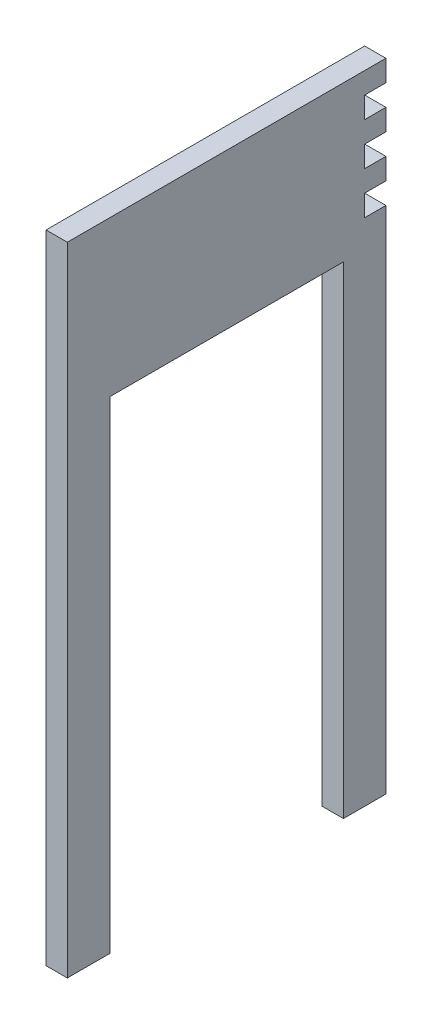
ISO-10303-21;
HEADER;
FILE_DESCRIPTION(('STEP AP214'),'2;1');
FILE_NAME('part.step','',(''),(''),'','','');
FILE_SCHEMA(('AUTOMOTIVE_DESIGN { 1 0 10303 214 1 1 1 1 }'));
ENDSEC;
DATA;
#1=APPLICATION_CONTEXT('core data for automotive mechanical design processes');
#2=APPLICATION_PROTOCOL_DEFINITION('international standard','automotive_design',2000,#1);
#3=PRODUCT_CONTEXT('',#1,'mechanical');
#4=PRODUCT('Part','Part','',(#3));
#5=PRODUCT_RELATED_PRODUCT_CATEGORY('part','',(#4));
#6=PRODUCT_DEFINITION_FORMATION('','',#4);
#7=PRODUCT_DEFINITION_CONTEXT('part definition',#1,'design');
#8=PRODUCT_DEFINITION('design','',#6,#7);
#9=PRODUCT_DEFINITION_SHAPE('','',#8);
#10=(LENGTH_UNIT() NAMED_UNIT(*) SI_UNIT(.MILLI.,.METRE.));
#11=(NAMED_UNIT(*) PLANE_ANGLE_UNIT() SI_UNIT($,.RADIAN.));
#12=(NAMED_UNIT(*) SI_UNIT($,.STERADIAN.) SOLID_ANGLE_UNIT());
#13=UNCERTAINTY_MEASURE_WITH_UNIT(LENGTH_MEASURE(1.E-05),#10,'distance_accuracy_value','');
#14=(GEOMETRIC_REPRESENTATION_CONTEXT(3) GLOBAL_UNCERTAINTY_ASSIGNED_CONTEXT((#13)) GLOBAL_UNIT_ASSIGNED_CONTEXT((#10,
#11,#12)) REPRESENTATION_CONTEXT('',''));
#15=CARTESIAN_POINT('',(0.,0.,0.));
#16=DIRECTION('',(0.,0.,1.));
#17=DIRECTION('',(1.,0.,0.));
#18=AXIS2_PLACEMENT_3D('',#15,#16,#17);
#19=CARTESIAN_POINT('',(10.,0.,0.));
#20=DIRECTION('',(0.,0.,1.));
#21=DIRECTION('',(0.,-1.,0.));
#22=AXIS2_PLACEMENT_3D('',#19,#20,#21);
#23=PLANE('',#22);
#24=DIRECTION('',(0.,1.,0.));
#25=VECTOR('',#24,1.);
#26=CARTESIAN_POINT('',(0.,0.,0.));
#27=LINE('',#26,#25);
#28=CARTESIAN_POINT('',(0.,-300.,0.));
#29=VERTEX_POINT('',#28);
#30=CARTESIAN_POINT('',(0.,-60.,0.));
#31=VERTEX_POINT('',#30);
#32=EDGE_CURVE('E194',#29,#31,#27,.T.);
#33=ORIENTED_EDGE('',*,*,#32,.T.);
#34=DIRECTION('',(1.,0.,0.));
#35=VECTOR('',#34,1.);
#36=CARTESIAN_POINT('',(0.,-60.,0.));
#37=LINE('',#36,#35);
#38=CARTESIAN_POINT('',(10.,-60.,0.));
#39=VERTEX_POINT('',#38);
#40=EDGE_CURVE('E283',#31,#39,#37,.T.);
#41=ORIENTED_EDGE('',*,*,#40,.T.);
#42=DIRECTION('',(0.,1.,0.));
#43=VECTOR('',#42,1.);
#44=CARTESIAN_POINT('',(10.,0.,0.));
#45=LINE('',#44,#43);
#46=CARTESIAN_POINT('',(10.,-300.,0.));
#47=VERTEX_POINT('',#46);
#48=EDGE_CURVE('E276',#47,#39,#45,.T.);
#49=ORIENTED_EDGE('',*,*,#48,.F.);
#50=DIRECTION('',(-1.,0.,0.));
#51=VECTOR('',#50,1.);
#52=CARTESIAN_POINT('',(10.,-300.,0.));
#53=LINE('',#52,#51);
#54=EDGE_CURVE('E218',#47,#29,#53,.T.);
#55=ORIENTED_EDGE('',*,*,#54,.T.);
#56=EDGE_LOOP('',(#33,#41,#49,#55));
#57=FACE_BOUND('',#56,.T.);
#58=ADVANCED_FACE('F33',(#57),#23,.F.);
#59=CARTESIAN_POINT('',(10.,-50.,0.));
#60=VERTEX_POINT('',#59);
#61=CARTESIAN_POINT('',(10.,-40.,0.));
#62=VERTEX_POINT('',#61);
#63=EDGE_CURVE('E186',#60,#62,#45,.T.);
#64=ORIENTED_EDGE('',*,*,#63,.F.);
#65=DIRECTION('',(1.,0.,0.));
#66=VECTOR('',#65,1.);
#67=CARTESIAN_POINT('',(0.,-50.,0.));
#68=LINE('',#67,#66);
#69=CARTESIAN_POINT('',(0.,-50.,0.));
#70=VERTEX_POINT('',#69);
#71=EDGE_CURVE('E173',#70,#60,#68,.T.);
#72=ORIENTED_EDGE('',*,*,#71,.F.);
#73=CARTESIAN_POINT('',(0.,-40.,0.));
#74=VERTEX_POINT('',#73);
#75=EDGE_CURVE('E184',#70,#74,#27,.T.);
#76=ORIENTED_EDGE('',*,*,#75,.T.);
#77=DIRECTION('',(1.,0.,0.));
#78=VECTOR('',#77,1.);
#79=CARTESIAN_POINT('',(0.,-40.,0.));
#80=LINE('',#79,#78);
#81=EDGE_CURVE('E333',#74,#62,#80,.T.);
#82=ORIENTED_EDGE('',*,*,#81,.T.);
#83=EDGE_LOOP('',(#64,#72,#76,#82));
#84=FACE_BOUND('',#83,.T.);
#85=ADVANCED_FACE('F182',(#84),#23,.F.);
#86=CARTESIAN_POINT('',(10.,-30.,0.));
#87=VERTEX_POINT('',#86);
#88=CARTESIAN_POINT('',(10.,-20.,0.));
#89=VERTEX_POINT('',#88);
#90=EDGE_CURVE('E287',#87,#89,#45,.T.);
#91=ORIENTED_EDGE('',*,*,#90,.F.);
#92=DIRECTION('',(1.,0.,0.));
#93=VECTOR('',#92,1.);
#94=CARTESIAN_POINT('',(0.,-30.,0.));
#95=LINE('',#94,#93);
#96=CARTESIAN_POINT('',(0.,-30.,0.));
#97=VERTEX_POINT('',#96);
#98=EDGE_CURVE('E546',#97,#87,#95,.T.);
#99=ORIENTED_EDGE('',*,*,#98,.F.);
#100=CARTESIAN_POINT('',(0.,-20.,0.));
#101=VERTEX_POINT('',#100);
#102=EDGE_CURVE('E195',#97,#101,#27,.T.);
#103=ORIENTED_EDGE('',*,*,#102,.T.);
#104=DIRECTION('',(1.,0.,0.));
#105=VECTOR('',#104,1.);
#106=CARTESIAN_POINT('',(0.,-20.,0.));
#107=LINE('',#106,#105);
#108=EDGE_CURVE('E307',#101,#89,#107,.T.);
#109=ORIENTED_EDGE('',*,*,#108,.T.);
#110=EDGE_LOOP('',(#91,#99,#103,#109));
#111=FACE_BOUND('',#110,.T.);
#112=ADVANCED_FACE('F314',(#111),#23,.F.);
#113=CARTESIAN_POINT('',(10.,-10.,0.));
#114=VERTEX_POINT('',#113);
#115=CARTESIAN_POINT('',(10.,0.,0.));
#116=VERTEX_POINT('',#115);
#117=EDGE_CURVE('E217',#114,#116,#45,.T.);
#118=ORIENTED_EDGE('',*,*,#117,.F.);
#119=DIRECTION('',(1.,0.,0.));
#120=VECTOR('',#119,1.);
#121=CARTESIAN_POINT('',(0.,-10.,0.));
#122=LINE('',#121,#120);
#123=CARTESIAN_POINT('',(0.,-10.,0.));
#124=VERTEX_POINT('',#123);
#125=EDGE_CURVE('E321',#124,#114,#122,.T.);
#126=ORIENTED_EDGE('',*,*,#125,.F.);
#127=CARTESIAN_POINT('',(0.,0.,0.));
#128=VERTEX_POINT('',#127);
#129=EDGE_CURVE('E199',#124,#128,#27,.T.);
#130=ORIENTED_EDGE('',*,*,#129,.T.);
#131=DIRECTION('',(-1.,0.,0.));
#132=VECTOR('',#131,1.);
#133=CARTESIAN_POINT('',(10.,0.,0.));
#134=LINE('',#133,#132);
#135=EDGE_CURVE('E11',#116,#128,#134,.T.);
#136=ORIENTED_EDGE('',*,*,#135,.F.);
#137=EDGE_LOOP('',(#118,#126,#130,#136));
#138=FACE_BOUND('',#137,.T.);
#139=ADVANCED_FACE('F35',(#138),#23,.F.);
#140=CARTESIAN_POINT('',(10.,0.,0.));
#141=DIRECTION('',(0.,-1.,0.));
#142=DIRECTION('',(0.,0.,-1.));
#143=AXIS2_PLACEMENT_3D('',#140,#141,#142);
#144=PLANE('',#143);
#145=DIRECTION('',(0.,0.,1.));
#146=VECTOR('',#145,1.);
#147=CARTESIAN_POINT('',(0.,0.,0.));
#148=LINE('',#147,#146);
#149=CARTESIAN_POINT('',(0.,0.,150.));
#150=VERTEX_POINT('',#149);
#151=EDGE_CURVE('E198',#128,#150,#148,.T.);
#152=ORIENTED_EDGE('',*,*,#151,.T.);
#153=DIRECTION('',(-1.,0.,0.));
#154=VECTOR('',#153,1.);
#155=CARTESIAN_POINT('',(10.,0.,150.));
#156=LINE('',#155,#154);
#157=CARTESIAN_POINT('',(10.,0.,150.));
#158=VERTEX_POINT('',#157);
#159=EDGE_CURVE('E41',#158,#150,#156,.T.);
#160=ORIENTED_EDGE('',*,*,#159,.F.);
#161=DIRECTION('',(0.,0.,1.));
#162=VECTOR('',#161,1.);
#163=CARTESIAN_POINT('',(10.,0.,0.));
#164=LINE('',#163,#162);
#165=EDGE_CURVE('E284',#116,#158,#164,.T.);
#166=ORIENTED_EDGE('',*,*,#165,.F.);
#167=ORIENTED_EDGE('',*,*,#135,.T.);
#168=EDGE_LOOP('',(#152,#160,#166,#167));
#169=FACE_BOUND('',#168,.T.);
#170=ADVANCED_FACE('F339',(#169),#144,.F.);
#171=CARTESIAN_POINT('',(10.,0.,150.));
#172=DIRECTION('',(0.,0.,-1.));
#173=DIRECTION('',(0.,1.,0.));
#174=AXIS2_PLACEMENT_3D('',#171,#172,#173);
#175=PLANE('',#174);
#176=DIRECTION('',(0.,-1.,0.));
#177=VECTOR('',#176,1.);
#178=CARTESIAN_POINT('',(0.,0.,150.));
#179=LINE('',#178,#177);
#180=CARTESIAN_POINT('',(0.,-300.,150.));
#181=VERTEX_POINT('',#180);
#182=EDGE_CURVE('E205',#150,#181,#179,.T.);
#183=ORIENTED_EDGE('',*,*,#182,.T.);
#184=DIRECTION('',(-1.,0.,0.));
#185=VECTOR('',#184,1.);
#186=CARTESIAN_POINT('',(10.,-300.,150.));
#187=LINE('',#186,#185);
#188=CARTESIAN_POINT('',(10.,-300.,150.));
#189=VERTEX_POINT('',#188);
#190=EDGE_CURVE('E233',#189,#181,#187,.T.);
#191=ORIENTED_EDGE('',*,*,#190,.F.);
#192=DIRECTION('',(0.,-1.,0.));
#193=VECTOR('',#192,1.);
#194=CARTESIAN_POINT('',(10.,0.,150.));
#195=LINE('',#194,#193);
#196=EDGE_CURVE('E242',#158,#189,#195,.T.);
#197=ORIENTED_EDGE('',*,*,#196,.F.);
#198=ORIENTED_EDGE('',*,*,#159,.T.);
#199=EDGE_LOOP('',(#183,#191,#197,#198));
#200=FACE_BOUND('',#199,.T.);
#201=ADVANCED_FACE('F240',(#200),#175,.F.);
#202=CARTESIAN_POINT('',(10.,-300.,130.));
#203=DIRECTION('',(0.,1.,0.));
#204=DIRECTION('',(0.,0.,1.));
#205=AXIS2_PLACEMENT_3D('',#202,#203,#204);
#206=PLANE('',#205);
#207=DIRECTION('',(0.,0.,-1.));
#208=VECTOR('',#207,1.);
#209=CARTESIAN_POINT('',(0.,-300.,130.));
#210=LINE('',#209,#208);
#211=CARTESIAN_POINT('',(0.,-300.,130.));
#212=VERTEX_POINT('',#211);
#213=EDGE_CURVE('E207',#181,#212,#210,.T.);
#214=ORIENTED_EDGE('',*,*,#213,.T.);
#215=DIRECTION('',(-1.,0.,0.));
#216=VECTOR('',#215,1.);
#217=CARTESIAN_POINT('',(10.,-300.,130.));
#218=LINE('',#217,#216);
#219=CARTESIAN_POINT('',(10.,-300.,130.));
#220=VERTEX_POINT('',#219);
#221=EDGE_CURVE('E230',#220,#212,#218,.T.);
#222=ORIENTED_EDGE('',*,*,#221,.F.);
#223=DIRECTION('',(0.,0.,-1.));
#224=VECTOR('',#223,1.);
#225=CARTESIAN_POINT('',(10.,-300.,130.));
#226=LINE('',#225,#224);
#227=EDGE_CURVE('E262',#189,#220,#226,.T.);
#228=ORIENTED_EDGE('',*,*,#227,.F.);
#229=ORIENTED_EDGE('',*,*,#190,.T.);
#230=EDGE_LOOP('',(#214,#222,#228,#229));
#231=FACE_BOUND('',#230,.T.);
#232=ADVANCED_FACE('F252',(#231),#206,.F.);
#233=CARTESIAN_POINT('',(10.,-73.,130.));
#234=DIRECTION('',(0.,0.,1.));
#235=DIRECTION('',(0.,-1.,0.));
#236=AXIS2_PLACEMENT_3D('',#233,#234,#235);
#237=PLANE('',#236);
#238=DIRECTION('',(0.,1.,0.));
#239=VECTOR('',#238,1.);
#240=CARTESIAN_POINT('',(0.,-73.,130.));
#241=LINE('',#240,#239);
#242=CARTESIAN_POINT('',(0.,-73.,130.));
#243=VERTEX_POINT('',#242);
#244=EDGE_CURVE('E209',#212,#243,#241,.T.);
#245=ORIENTED_EDGE('',*,*,#244,.T.);
#246=DIRECTION('',(-1.,0.,0.));
#247=VECTOR('',#246,1.);
#248=CARTESIAN_POINT('',(10.,-73.,130.));
#249=LINE('',#248,#247);
#250=CARTESIAN_POINT('',(10.,-73.,130.));
#251=VERTEX_POINT('',#250);
#252=EDGE_CURVE('E227',#251,#243,#249,.T.);
#253=ORIENTED_EDGE('',*,*,#252,.F.);
#254=DIRECTION('',(0.,1.,0.));
#255=VECTOR('',#254,1.);
#256=CARTESIAN_POINT('',(10.,-73.,130.));
#257=LINE('',#256,#255);
#258=EDGE_CURVE('E258',#220,#251,#257,.T.);
#259=ORIENTED_EDGE('',*,*,#258,.F.);
#260=ORIENTED_EDGE('',*,*,#221,.T.);
#261=EDGE_LOOP('',(#245,#253,#259,#260));
#262=FACE_BOUND('',#261,.T.);
#263=ADVANCED_FACE('F256',(#262),#237,.F.);
#264=CARTESIAN_POINT('',(10.,-73.,20.));
#265=DIRECTION('',(0.,1.,0.));
#266=DIRECTION('',(0.,0.,1.));
#267=AXIS2_PLACEMENT_3D('',#264,#265,#266);
#268=PLANE('',#267);
#269=DIRECTION('',(0.,0.,-1.));
#270=VECTOR('',#269,1.);
#271=CARTESIAN_POINT('',(0.,-73.,20.));
#272=LINE('',#271,#270);
#273=CARTESIAN_POINT('',(0.,-73.,20.));
#274=VERTEX_POINT('',#273);
#275=EDGE_CURVE('E211',#243,#274,#272,.T.);
#276=ORIENTED_EDGE('',*,*,#275,.T.);
#277=DIRECTION('',(-1.,0.,0.));
#278=VECTOR('',#277,1.);
#279=CARTESIAN_POINT('',(10.,-73.,20.));
#280=LINE('',#279,#278);
#281=CARTESIAN_POINT('',(10.,-73.,20.));
#282=VERTEX_POINT('',#281);
#283=EDGE_CURVE('E224',#282,#274,#280,.T.);
#284=ORIENTED_EDGE('',*,*,#283,.F.);
#285=DIRECTION('',(0.,0.,-1.));
#286=VECTOR('',#285,1.);
#287=CARTESIAN_POINT('',(10.,-73.,20.));
#288=LINE('',#287,#286);
#289=EDGE_CURVE('E261',#251,#282,#288,.T.);
#290=ORIENTED_EDGE('',*,*,#289,.F.);
#291=ORIENTED_EDGE('',*,*,#252,.T.);
#292=EDGE_LOOP('',(#276,#284,#290,#291));
#293=FACE_BOUND('',#292,.T.);
#294=ADVANCED_FACE('F469',(#293),#268,.F.);
#295=CARTESIAN_POINT('',(10.,-300.,20.));
#296=DIRECTION('',(0.,0.,-1.));
#297=DIRECTION('',(-1.,0.,0.));
#298=AXIS2_PLACEMENT_3D('',#295,#296,#297);
#299=PLANE('',#298);
#300=DIRECTION('',(0.,-1.,0.));
#301=VECTOR('',#300,1.);
#302=CARTESIAN_POINT('',(0.,-300.,20.));
#303=LINE('',#302,#301);
#304=CARTESIAN_POINT('',(0.,-300.,20.));
#305=VERTEX_POINT('',#304);
#306=EDGE_CURVE('E213',#274,#305,#303,.T.);
#307=ORIENTED_EDGE('',*,*,#306,.T.);
#308=DIRECTION('',(-1.,0.,0.));
#309=VECTOR('',#308,1.);
#310=CARTESIAN_POINT('',(10.,-300.,20.));
#311=LINE('',#310,#309);
#312=CARTESIAN_POINT('',(10.,-300.,20.));
#313=VERTEX_POINT('',#312);
#314=EDGE_CURVE('E221',#313,#305,#311,.T.);
#315=ORIENTED_EDGE('',*,*,#314,.F.);
#316=DIRECTION('',(0.,-1.,0.));
#317=VECTOR('',#316,1.);
#318=CARTESIAN_POINT('',(10.,-300.,20.));
#319=LINE('',#318,#317);
#320=EDGE_CURVE('E264',#282,#313,#319,.T.);
#321=ORIENTED_EDGE('',*,*,#320,.F.);
#322=ORIENTED_EDGE('',*,*,#283,.T.);
#323=EDGE_LOOP('',(#307,#315,#321,#322));
#324=FACE_BOUND('',#323,.T.);
#325=ADVANCED_FACE('F466',(#324),#299,.F.);
#326=CARTESIAN_POINT('',(10.,-300.,0.));
#327=DIRECTION('',(0.,1.,0.));
#328=DIRECTION('',(0.,0.,1.));
#329=AXIS2_PLACEMENT_3D('',#326,#327,#328);
#330=PLANE('',#329);
#331=DIRECTION('',(0.,0.,-1.));
#332=VECTOR('',#331,1.);
#333=CARTESIAN_POINT('',(0.,-300.,0.));
#334=LINE('',#333,#332);
#335=EDGE_CURVE('E215',#305,#29,#334,.T.);
#336=ORIENTED_EDGE('',*,*,#335,.T.);
#337=ORIENTED_EDGE('',*,*,#54,.F.);
#338=DIRECTION('',(0.,0.,-1.));
#339=VECTOR('',#338,1.);
#340=CARTESIAN_POINT('',(10.,-300.,0.));
#341=LINE('',#340,#339);
#342=EDGE_CURVE('E202',#313,#47,#341,.T.);
#343=ORIENTED_EDGE('',*,*,#342,.F.);
#344=ORIENTED_EDGE('',*,*,#314,.T.);
#345=EDGE_LOOP('',(#336,#337,#343,#344));
#346=FACE_BOUND('',#345,.T.);
#347=ADVANCED_FACE('F278',(#346),#330,.F.);
#348=CARTESIAN_POINT('',(10.,0.,0.));
#349=DIRECTION('',(-1.,0.,0.));
#350=DIRECTION('',(0.,0.,1.));
#351=AXIS2_PLACEMENT_3D('',#348,#349,#350);
#352=PLANE('',#351);
#353=ORIENTED_EDGE('',*,*,#48,.T.);
#354=DIRECTION('',(0.,0.,-1.));
#355=VECTOR('',#354,1.);
#356=CARTESIAN_POINT('',(10.,-60.,0.));
#357=LINE('',#356,#355);
#358=CARTESIAN_POINT('',(10.,-60.,9.99999999999999));
#359=VERTEX_POINT('',#358);
#360=EDGE_CURVE('E178',#359,#39,#357,.T.);
#361=ORIENTED_EDGE('',*,*,#360,.F.);
#362=DIRECTION('',(0.,-1.,0.));
#363=VECTOR('',#362,1.);
#364=CARTESIAN_POINT('',(10.,-50.,9.99999999999999));
#365=LINE('',#364,#363);
#366=CARTESIAN_POINT('',(10.,-50.,9.99999999999999));
#367=VERTEX_POINT('',#366);
#368=EDGE_CURVE('E532',#367,#359,#365,.T.);
#369=ORIENTED_EDGE('',*,*,#368,.F.);
#370=DIRECTION('',(0.,0.,1.));
#371=VECTOR('',#370,1.);
#372=CARTESIAN_POINT('',(10.,-50.,0.));
#373=LINE('',#372,#371);
#374=EDGE_CURVE('E530',#60,#367,#373,.T.);
#375=ORIENTED_EDGE('',*,*,#374,.F.);
#376=ORIENTED_EDGE('',*,*,#63,.T.);
#377=DIRECTION('',(0.,0.,-1.));
#378=VECTOR('',#377,1.);
#379=CARTESIAN_POINT('',(10.,-40.,0.));
#380=LINE('',#379,#378);
#381=CARTESIAN_POINT('',(10.,-40.,9.99999999999999));
#382=VERTEX_POINT('',#381);
#383=EDGE_CURVE('E543',#382,#62,#380,.T.);
#384=ORIENTED_EDGE('',*,*,#383,.F.);
#385=DIRECTION('',(0.,-1.,0.));
#386=VECTOR('',#385,1.);
#387=CARTESIAN_POINT('',(10.,-30.,10.));
#388=LINE('',#387,#386);
#389=CARTESIAN_POINT('',(10.,-30.,10.));
#390=VERTEX_POINT('',#389);
#391=EDGE_CURVE('E548',#390,#382,#388,.T.);
#392=ORIENTED_EDGE('',*,*,#391,.F.);
#393=DIRECTION('',(0.,0.,1.));
#394=VECTOR('',#393,1.);
#395=CARTESIAN_POINT('',(10.,-30.,0.));
#396=LINE('',#395,#394);
#397=EDGE_CURVE('E299',#87,#390,#396,.T.);
#398=ORIENTED_EDGE('',*,*,#397,.F.);
#399=ORIENTED_EDGE('',*,*,#90,.T.);
#400=DIRECTION('',(0.,0.,-1.));
#401=VECTOR('',#400,1.);
#402=CARTESIAN_POINT('',(10.,-20.,0.));
#403=LINE('',#402,#401);
#404=CARTESIAN_POINT('',(10.,-20.,10.));
#405=VERTEX_POINT('',#404);
#406=EDGE_CURVE('E296',#405,#89,#403,.T.);
#407=ORIENTED_EDGE('',*,*,#406,.F.);
#408=DIRECTION('',(0.,-1.,0.));
#409=VECTOR('',#408,1.);
#410=CARTESIAN_POINT('',(10.,-10.,10.));
#411=LINE('',#410,#409);
#412=CARTESIAN_POINT('',(10.,-10.,10.));
#413=VERTEX_POINT('',#412);
#414=EDGE_CURVE('E312',#413,#405,#411,.T.);
#415=ORIENTED_EDGE('',*,*,#414,.F.);
#416=DIRECTION('',(0.,0.,1.));
#417=VECTOR('',#416,1.);
#418=CARTESIAN_POINT('',(10.,-10.,0.));
#419=LINE('',#418,#417);
#420=EDGE_CURVE('E332',#114,#413,#419,.T.);
#421=ORIENTED_EDGE('',*,*,#420,.F.);
#422=ORIENTED_EDGE('',*,*,#117,.T.);
#423=ORIENTED_EDGE('',*,*,#165,.T.);
#424=ORIENTED_EDGE('',*,*,#196,.T.);
#425=ORIENTED_EDGE('',*,*,#227,.T.);
#426=ORIENTED_EDGE('',*,*,#258,.T.);
#427=ORIENTED_EDGE('',*,*,#289,.T.);
#428=ORIENTED_EDGE('',*,*,#320,.T.);
#429=ORIENTED_EDGE('',*,*,#342,.T.);
#430=EDGE_LOOP('',(#353,#361,#369,#375,#376,#384,#392,#398,#399,#407,#415,#421,#422,#423,#424,
#425,#426,#427,#428,#429));
#431=FACE_BOUND('',#430,.T.);
#432=ADVANCED_FACE('F273',(#431),#352,.F.);
#433=CARTESIAN_POINT('',(0.,0.,0.));
#434=DIRECTION('',(-1.,0.,0.));
#435=DIRECTION('',(0.,0.,1.));
#436=AXIS2_PLACEMENT_3D('',#433,#434,#435);
#437=PLANE('',#436);
#438=DIRECTION('',(0.,0.,-1.));
#439=VECTOR('',#438,1.);
#440=CARTESIAN_POINT('',(0.,-60.,0.));
#441=LINE('',#440,#439);
#442=CARTESIAN_POINT('',(0.,-60.,9.99999999999999));
#443=VERTEX_POINT('',#442);
#444=EDGE_CURVE('E187',#443,#31,#441,.T.);
#445=ORIENTED_EDGE('',*,*,#444,.T.);
#446=ORIENTED_EDGE('',*,*,#32,.F.);
#447=ORIENTED_EDGE('',*,*,#335,.F.);
#448=ORIENTED_EDGE('',*,*,#306,.F.);
#449=ORIENTED_EDGE('',*,*,#275,.F.);
#450=ORIENTED_EDGE('',*,*,#244,.F.);
#451=ORIENTED_EDGE('',*,*,#213,.F.);
#452=ORIENTED_EDGE('',*,*,#182,.F.);
#453=ORIENTED_EDGE('',*,*,#151,.F.);
#454=ORIENTED_EDGE('',*,*,#129,.F.);
#455=DIRECTION('',(0.,0.,1.));
#456=VECTOR('',#455,1.);
#457=CARTESIAN_POINT('',(0.,-10.,0.));
#458=LINE('',#457,#456);
#459=CARTESIAN_POINT('',(0.,-10.,10.));
#460=VERTEX_POINT('',#459);
#461=EDGE_CURVE('E311',#124,#460,#458,.T.);
#462=ORIENTED_EDGE('',*,*,#461,.T.);
#463=DIRECTION('',(0.,-1.,0.));
#464=VECTOR('',#463,1.);
#465=CARTESIAN_POINT('',(0.,-10.,10.));
#466=LINE('',#465,#464);
#467=CARTESIAN_POINT('',(0.,-20.,10.));
#468=VERTEX_POINT('',#467);
#469=EDGE_CURVE('E326',#460,#468,#466,.T.);
#470=ORIENTED_EDGE('',*,*,#469,.T.);
#471=DIRECTION('',(0.,0.,-1.));
#472=VECTOR('',#471,1.);
#473=CARTESIAN_POINT('',(0.,-20.,0.));
#474=LINE('',#473,#472);
#475=EDGE_CURVE('E322',#468,#101,#474,.T.);
#476=ORIENTED_EDGE('',*,*,#475,.T.);
#477=ORIENTED_EDGE('',*,*,#102,.F.);
#478=DIRECTION('',(0.,0.,1.));
#479=VECTOR('',#478,1.);
#480=CARTESIAN_POINT('',(0.,-30.,0.));
#481=LINE('',#480,#479);
#482=CARTESIAN_POINT('',(0.,-30.,10.));
#483=VERTEX_POINT('',#482);
#484=EDGE_CURVE('E540',#97,#483,#481,.T.);
#485=ORIENTED_EDGE('',*,*,#484,.T.);
#486=DIRECTION('',(0.,-1.,0.));
#487=VECTOR('',#486,1.);
#488=CARTESIAN_POINT('',(0.,-30.,10.));
#489=LINE('',#488,#487);
#490=CARTESIAN_POINT('',(0.,-40.,9.99999999999999));
#491=VERTEX_POINT('',#490);
#492=EDGE_CURVE('E56',#483,#491,#489,.T.);
#493=ORIENTED_EDGE('',*,*,#492,.T.);
#494=DIRECTION('',(0.,0.,-1.));
#495=VECTOR('',#494,1.);
#496=CARTESIAN_POINT('',(0.,-40.,0.));
#497=LINE('',#496,#495);
#498=EDGE_CURVE('E193',#491,#74,#497,.T.);
#499=ORIENTED_EDGE('',*,*,#498,.T.);
#500=ORIENTED_EDGE('',*,*,#75,.F.);
#501=DIRECTION('',(0.,0.,1.));
#502=VECTOR('',#501,1.);
#503=CARTESIAN_POINT('',(0.,-50.,0.));
#504=LINE('',#503,#502);
#505=CARTESIAN_POINT('',(0.,-50.,9.99999999999999));
#506=VERTEX_POINT('',#505);
#507=EDGE_CURVE('E169',#70,#506,#504,.T.);
#508=ORIENTED_EDGE('',*,*,#507,.T.);
#509=DIRECTION('',(0.,-1.,0.));
#510=VECTOR('',#509,1.);
#511=CARTESIAN_POINT('',(0.,-50.,9.99999999999999));
#512=LINE('',#511,#510);
#513=EDGE_CURVE('E48',#506,#443,#512,.T.);
#514=ORIENTED_EDGE('',*,*,#513,.T.);
#515=EDGE_LOOP('',(#445,#446,#447,#448,#449,#450,#451,#452,#453,#454,#462,#470,#476,#477,#485,
#493,#499,#500,#508,#514));
#516=FACE_BOUND('',#515,.T.);
#517=ADVANCED_FACE('F191',(#516),#437,.T.);
#518=CARTESIAN_POINT('',(0.,-20.,0.));
#519=DIRECTION('',(0.,-1.,0.));
#520=DIRECTION('',(0.,0.,-1.));
#521=AXIS2_PLACEMENT_3D('',#518,#519,#520);
#522=PLANE('',#521);
#523=ORIENTED_EDGE('',*,*,#406,.T.);
#524=ORIENTED_EDGE('',*,*,#108,.F.);
#525=ORIENTED_EDGE('',*,*,#475,.F.);
#526=DIRECTION('',(1.,0.,0.));
#527=VECTOR('',#526,1.);
#528=CARTESIAN_POINT('',(0.,-20.,10.));
#529=LINE('',#528,#527);
#530=EDGE_CURVE('E309',#468,#405,#529,.T.);
#531=ORIENTED_EDGE('',*,*,#530,.T.);
#532=EDGE_LOOP('',(#523,#524,#525,#531));
#533=FACE_BOUND('',#532,.T.);
#534=ADVANCED_FACE('F305',(#533),#522,.F.);
#535=CARTESIAN_POINT('',(0.,-10.,10.));
#536=DIRECTION('',(0.,0.,1.));
#537=DIRECTION('',(0.,-1.,0.));
#538=AXIS2_PLACEMENT_3D('',#535,#536,#537);
#539=PLANE('',#538);
#540=ORIENTED_EDGE('',*,*,#414,.T.);
#541=ORIENTED_EDGE('',*,*,#530,.F.);
#542=ORIENTED_EDGE('',*,*,#469,.F.);
#543=DIRECTION('',(1.,0.,0.));
#544=VECTOR('',#543,1.);
#545=CARTESIAN_POINT('',(0.,-10.,10.));
#546=LINE('',#545,#544);
#547=EDGE_CURVE('E317',#460,#413,#546,.T.);
#548=ORIENTED_EDGE('',*,*,#547,.T.);
#549=EDGE_LOOP('',(#540,#541,#542,#548));
#550=FACE_BOUND('',#549,.T.);
#551=ADVANCED_FACE('F335',(#550),#539,.F.);
#552=CARTESIAN_POINT('',(0.,-10.,0.));
#553=DIRECTION('',(0.,1.,0.));
#554=DIRECTION('',(0.,0.,1.));
#555=AXIS2_PLACEMENT_3D('',#552,#553,#554);
#556=PLANE('',#555);
#557=ORIENTED_EDGE('',*,*,#420,.T.);
#558=ORIENTED_EDGE('',*,*,#547,.F.);
#559=ORIENTED_EDGE('',*,*,#461,.F.);
#560=ORIENTED_EDGE('',*,*,#125,.T.);
#561=EDGE_LOOP('',(#557,#558,#559,#560));
#562=FACE_BOUND('',#561,.T.);
#563=ADVANCED_FACE('F384',(#562),#556,.F.);
#564=CARTESIAN_POINT('',(0.,-40.,0.));
#565=DIRECTION('',(0.,-1.,0.));
#566=DIRECTION('',(0.,0.,-1.));
#567=AXIS2_PLACEMENT_3D('',#564,#565,#566);
#568=PLANE('',#567);
#569=ORIENTED_EDGE('',*,*,#383,.T.);
#570=ORIENTED_EDGE('',*,*,#81,.F.);
#571=ORIENTED_EDGE('',*,*,#498,.F.);
#572=DIRECTION('',(1.,0.,0.));
#573=VECTOR('',#572,1.);
#574=CARTESIAN_POINT('',(0.,-40.,9.99999999999999));
#575=LINE('',#574,#573);
#576=EDGE_CURVE('E554',#491,#382,#575,.T.);
#577=ORIENTED_EDGE('',*,*,#576,.T.);
#578=EDGE_LOOP('',(#569,#570,#571,#577));
#579=FACE_BOUND('',#578,.T.);
#580=ADVANCED_FACE('F392',(#579),#568,.F.);
#581=CARTESIAN_POINT('',(0.,-30.,10.));
#582=DIRECTION('',(0.,0.,1.));
#583=DIRECTION('',(0.,-1.,0.));
#584=AXIS2_PLACEMENT_3D('',#581,#582,#583);
#585=PLANE('',#584);
#586=ORIENTED_EDGE('',*,*,#391,.T.);
#587=ORIENTED_EDGE('',*,*,#576,.F.);
#588=ORIENTED_EDGE('',*,*,#492,.F.);
#589=DIRECTION('',(1.,0.,0.));
#590=VECTOR('',#589,1.);
#591=CARTESIAN_POINT('',(0.,-30.,10.));
#592=LINE('',#591,#590);
#593=EDGE_CURVE('E556',#483,#390,#592,.T.);
#594=ORIENTED_EDGE('',*,*,#593,.T.);
#595=EDGE_LOOP('',(#586,#587,#588,#594));
#596=FACE_BOUND('',#595,.T.);
#597=ADVANCED_FACE('F411',(#596),#585,.F.);
#598=CARTESIAN_POINT('',(0.,-30.,0.));
#599=DIRECTION('',(0.,1.,0.));
#600=DIRECTION('',(0.,0.,1.));
#601=AXIS2_PLACEMENT_3D('',#598,#599,#600);
#602=PLANE('',#601);
#603=ORIENTED_EDGE('',*,*,#397,.T.);
#604=ORIENTED_EDGE('',*,*,#593,.F.);
#605=ORIENTED_EDGE('',*,*,#484,.F.);
#606=ORIENTED_EDGE('',*,*,#98,.T.);
#607=EDGE_LOOP('',(#603,#604,#605,#606));
#608=FACE_BOUND('',#607,.T.);
#609=ADVANCED_FACE('F421',(#608),#602,.F.);
#610=CARTESIAN_POINT('',(0.,-60.,0.));
#611=DIRECTION('',(0.,-1.,0.));
#612=DIRECTION('',(0.,0.,-1.));
#613=AXIS2_PLACEMENT_3D('',#610,#611,#612);
#614=PLANE('',#613);
#615=ORIENTED_EDGE('',*,*,#360,.T.);
#616=ORIENTED_EDGE('',*,*,#40,.F.);
#617=ORIENTED_EDGE('',*,*,#444,.F.);
#618=DIRECTION('',(1.,0.,0.));
#619=VECTOR('',#618,1.);
#620=CARTESIAN_POINT('',(0.,-60.,9.99999999999999));
#621=LINE('',#620,#619);
#622=EDGE_CURVE('E537',#443,#359,#621,.T.);
#623=ORIENTED_EDGE('',*,*,#622,.T.);
#624=EDGE_LOOP('',(#615,#616,#617,#623));
#625=FACE_BOUND('',#624,.T.);
#626=ADVANCED_FACE('F429',(#625),#614,.F.);
#627=CARTESIAN_POINT('',(0.,-50.,9.99999999999999));
#628=DIRECTION('',(0.,0.,1.));
#629=DIRECTION('',(0.,-1.,0.));
#630=AXIS2_PLACEMENT_3D('',#627,#628,#629);
#631=PLANE('',#630);
#632=ORIENTED_EDGE('',*,*,#368,.T.);
#633=ORIENTED_EDGE('',*,*,#622,.F.);
#634=ORIENTED_EDGE('',*,*,#513,.F.);
#635=DIRECTION('',(1.,0.,0.));
#636=VECTOR('',#635,1.);
#637=CARTESIAN_POINT('',(0.,-50.,9.99999999999999));
#638=LINE('',#637,#636);
#639=EDGE_CURVE('E175',#506,#367,#638,.T.);
#640=ORIENTED_EDGE('',*,*,#639,.T.);
#641=EDGE_LOOP('',(#632,#633,#634,#640));
#642=FACE_BOUND('',#641,.T.);
#643=ADVANCED_FACE('F438',(#642),#631,.F.);
#644=CARTESIAN_POINT('',(0.,-50.,0.));
#645=DIRECTION('',(0.,1.,0.));
#646=DIRECTION('',(0.,0.,1.));
#647=AXIS2_PLACEMENT_3D('',#644,#645,#646);
#648=PLANE('',#647);
#649=ORIENTED_EDGE('',*,*,#374,.T.);
#650=ORIENTED_EDGE('',*,*,#639,.F.);
#651=ORIENTED_EDGE('',*,*,#507,.F.);
#652=ORIENTED_EDGE('',*,*,#71,.T.);
#653=EDGE_LOOP('',(#649,#650,#651,#652));
#654=FACE_BOUND('',#653,.T.);
#655=ADVANCED_FACE('F172',(#654),#648,.F.);
#656=CLOSED_SHELL('',(#58,#85,#112,#139,#170,#201,#232,#263,#294,#325,#347,#432,#517,#534,#551,
#563,#580,#597,#609,#626,#643,#655));
#657=MANIFOLD_SOLID_BREP('B2',#656);
#658=ADVANCED_BREP_SHAPE_REPRESENTATION('',(#18,#657),#14);
#659=SHAPE_DEFINITION_REPRESENTATION(#9,#658);
ENDSEC;
END-ISO-10303-21;
